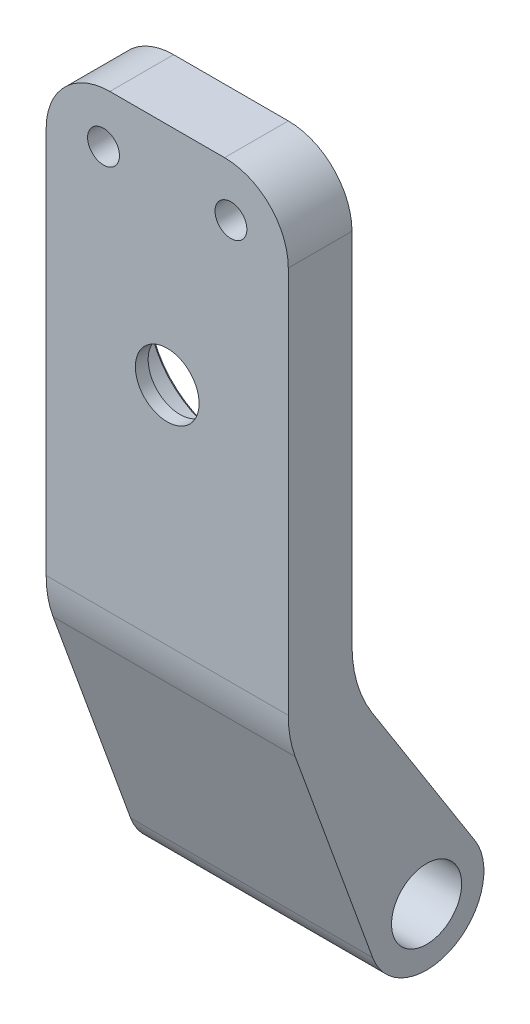
ISO-10303-21;
HEADER;
FILE_DESCRIPTION(('STEP AP214'),'2;1');
FILE_NAME('part.step','',(''),(''),'','','');
FILE_SCHEMA(('AUTOMOTIVE_DESIGN { 1 0 10303 214 1 1 1 1 }'));
ENDSEC;
DATA;
#1=APPLICATION_CONTEXT('core data for automotive mechanical design processes');
#2=APPLICATION_PROTOCOL_DEFINITION('international standard','automotive_design',2000,#1);
#3=PRODUCT_CONTEXT('',#1,'mechanical');
#4=PRODUCT('Part','Part','',(#3));
#5=PRODUCT_RELATED_PRODUCT_CATEGORY('part','',(#4));
#6=PRODUCT_DEFINITION_FORMATION('','',#4);
#7=PRODUCT_DEFINITION_CONTEXT('part definition',#1,'design');
#8=PRODUCT_DEFINITION('design','',#6,#7);
#9=PRODUCT_DEFINITION_SHAPE('','',#8);
#10=(LENGTH_UNIT() NAMED_UNIT(*) SI_UNIT(.MILLI.,.METRE.));
#11=(NAMED_UNIT(*) PLANE_ANGLE_UNIT() SI_UNIT($,.RADIAN.));
#12=(NAMED_UNIT(*) SI_UNIT($,.STERADIAN.) SOLID_ANGLE_UNIT());
#13=UNCERTAINTY_MEASURE_WITH_UNIT(LENGTH_MEASURE(1.E-05),#10,'distance_accuracy_value','');
#14=(GEOMETRIC_REPRESENTATION_CONTEXT(3) GLOBAL_UNCERTAINTY_ASSIGNED_CONTEXT((#13)) GLOBAL_UNIT_ASSIGNED_CONTEXT((#10,
#11,#12)) REPRESENTATION_CONTEXT('',''));
#15=CARTESIAN_POINT('',(0.,0.,0.));
#16=DIRECTION('',(0.,0.,1.));
#17=DIRECTION('',(1.,0.,0.));
#18=AXIS2_PLACEMENT_3D('',#15,#16,#17);
#19=CARTESIAN_POINT('',(0.,13.1015537091819,20.7143094769658));
#20=DIRECTION('',(0.,0.,-1.));
#21=DIRECTION('',(-1.,0.,0.));
#22=AXIS2_PLACEMENT_3D('',#19,#20,#21);
#23=CONICAL_SURFACE('',#22,6.,0.785398163397448);
#24=CARTESIAN_POINT('',(0.,13.1015537091819,20.2143094769658));
#25=DIRECTION('',(0.,0.,1.));
#26=DIRECTION('',(-1.,0.,0.));
#27=AXIS2_PLACEMENT_3D('',#24,#25,#26);
#28=CIRCLE('',#27,6.5);
#29=CARTESIAN_POINT('',(-6.5,13.1015537091819,20.2143094769658));
#30=VERTEX_POINT('',#29);
#31=EDGE_CURVE('E197',#30,#30,#28,.T.);
#32=ORIENTED_EDGE('',*,*,#31,.F.);
#33=EDGE_LOOP('',(#32));
#34=FACE_BOUND('',#33,.T.);
#35=CARTESIAN_POINT('',(0.,13.1015537091819,20.4643094769658));
#36=DIRECTION('',(0.,0.,-1.));
#37=DIRECTION('',(-1.,0.,0.));
#38=AXIS2_PLACEMENT_3D('',#35,#36,#37);
#39=CIRCLE('',#38,6.25);
#40=CARTESIAN_POINT('',(-6.25,13.1015537091819,20.4643094769658));
#41=VERTEX_POINT('',#40);
#42=EDGE_CURVE('E52',#41,#41,#39,.T.);
#43=ORIENTED_EDGE('',*,*,#42,.F.);
#44=EDGE_LOOP('',(#43));
#45=FACE_BOUND('',#44,.T.);
#46=ADVANCED_FACE('F48',(#34,#45),#23,.F.);
#47=CARTESIAN_POINT('',(9.5,7.60659887027264,25.2143094769657));
#48=DIRECTION('',(0.,0.,-1.));
#49=DIRECTION('',(-1.,0.,0.));
#50=AXIS2_PLACEMENT_3D('',#47,#48,#49);
#51=PLANE('',#50);
#52=CARTESIAN_POINT('',(0.,13.1015537091819,25.2143094769657));
#53=DIRECTION('',(0.,0.,-1.));
#54=DIRECTION('',(0.,1.,0.));
#55=AXIS2_PLACEMENT_3D('',#52,#53,#54);
#56=CIRCLE('',#55,2.5);
#57=CARTESIAN_POINT('',(0.,15.6015537091819,25.2143094769657));
#58=VERTEX_POINT('',#57);
#59=EDGE_CURVE('E13',#58,#58,#56,.T.);
#60=ORIENTED_EDGE('',*,*,#59,.T.);
#61=EDGE_LOOP('',(#60));
#62=FACE_BOUND('',#61,.T.);
#63=CARTESIAN_POINT('',(-5.,26.8080822959938,25.2143094769657));
#64=DIRECTION('',(0.,0.,1.));
#65=DIRECTION('',(0.,-1.,0.));
#66=AXIS2_PLACEMENT_3D('',#63,#64,#65);
#67=CIRCLE('',#66,1.25);
#68=CARTESIAN_POINT('',(-5.,25.5580822959938,25.2143094769657));
#69=VERTEX_POINT('',#68);
#70=EDGE_CURVE('E235',#69,#69,#67,.T.);
#71=ORIENTED_EDGE('',*,*,#70,.F.);
#72=EDGE_LOOP('',(#71));
#73=FACE_BOUND('',#72,.T.);
#74=CARTESIAN_POINT('',(5.,26.8080822959938,25.2143094769657));
#75=DIRECTION('',(0.,0.,1.));
#76=DIRECTION('',(0.,-1.,0.));
#77=AXIS2_PLACEMENT_3D('',#74,#75,#76);
#78=CIRCLE('',#77,1.25);
#79=CARTESIAN_POINT('',(5.,25.5580822959938,25.2143094769657));
#80=VERTEX_POINT('',#79);
#81=EDGE_CURVE('E229',#80,#80,#78,.T.);
#82=ORIENTED_EDGE('',*,*,#81,.F.);
#83=EDGE_LOOP('',(#82));
#84=FACE_BOUND('',#83,.T.);
#85=DIRECTION('',(-1.,0.,0.));
#86=VECTOR('',#85,1.);
#87=CARTESIAN_POINT('',(9.5,30.8080822959938,25.2143094769657));
#88=LINE('',#87,#86);
#89=CARTESIAN_POINT('',(4.5,30.8080822959938,25.2143094769657));
#90=VERTEX_POINT('',#89);
#91=CARTESIAN_POINT('',(-4.5,30.8080822959938,25.2143094769657));
#92=VERTEX_POINT('',#91);
#93=EDGE_CURVE('E58',#90,#92,#88,.T.);
#94=ORIENTED_EDGE('',*,*,#93,.T.);
#95=CARTESIAN_POINT('',(-4.5,25.8080822959938,25.2143094769657));
#96=DIRECTION('',(0.,0.,1.));
#97=DIRECTION('',(0.,1.,0.));
#98=AXIS2_PLACEMENT_3D('',#95,#96,#97);
#99=CIRCLE('',#98,5.);
#100=CARTESIAN_POINT('',(-9.5,25.8080822959938,25.2143094769657));
#101=VERTEX_POINT('',#100);
#102=EDGE_CURVE('E194',#92,#101,#99,.T.);
#103=ORIENTED_EDGE('',*,*,#102,.T.);
#104=DIRECTION('',(0.,-1.,0.));
#105=VECTOR('',#104,1.);
#106=CARTESIAN_POINT('',(-9.5,7.60659887027264,25.2143094769657));
#107=LINE('',#106,#105);
#108=CARTESIAN_POINT('',(-9.5,-4.59488455544854,25.2143094769657));
#109=VERTEX_POINT('',#108);
#110=EDGE_CURVE('E112',#101,#109,#107,.T.);
#111=ORIENTED_EDGE('',*,*,#110,.T.);
#112=DIRECTION('',(-1.,0.,0.));
#113=VECTOR('',#112,1.);
#114=CARTESIAN_POINT('',(9.5,-4.59488455544854,25.2143094769657));
#115=LINE('',#114,#113);
#116=CARTESIAN_POINT('',(9.5,-4.59488455544854,25.2143094769657));
#117=VERTEX_POINT('',#116);
#118=EDGE_CURVE('E122',#117,#109,#115,.T.);
#119=ORIENTED_EDGE('',*,*,#118,.F.);
#120=DIRECTION('',(0.,-1.,0.));
#121=VECTOR('',#120,1.);
#122=CARTESIAN_POINT('',(9.5,7.60659887027264,25.2143094769657));
#123=LINE('',#122,#121);
#124=CARTESIAN_POINT('',(9.5,25.8080822959938,25.2143094769657));
#125=VERTEX_POINT('',#124);
#126=EDGE_CURVE('E221',#125,#117,#123,.T.);
#127=ORIENTED_EDGE('',*,*,#126,.F.);
#128=CARTESIAN_POINT('',(4.5,25.8080822959938,25.2143094769657));
#129=DIRECTION('',(0.,0.,1.));
#130=DIRECTION('',(0.,1.,0.));
#131=AXIS2_PLACEMENT_3D('',#128,#129,#130);
#132=CIRCLE('',#131,5.);
#133=EDGE_CURVE('E195',#125,#90,#132,.T.);
#134=ORIENTED_EDGE('',*,*,#133,.T.);
#135=EDGE_LOOP('',(#94,#103,#111,#119,#127,#134));
#136=FACE_BOUND('',#135,.T.);
#137=ADVANCED_FACE('F50',(#62,#73,#84,#136),#51,.F.);
#138=CARTESIAN_POINT('',(9.5,-4.59488455544854,16.2143094769658));
#139=DIRECTION('',(-1.,0.,0.));
#140=DIRECTION('',(0.,0.,1.));
#141=AXIS2_PLACEMENT_3D('',#138,#139,#140);
#142=CYLINDRICAL_SURFACE('',#141,9.);
#143=CARTESIAN_POINT('',(-9.5,-4.59488455544854,16.2143094769658));
#144=DIRECTION('',(1.,0.,0.));
#145=DIRECTION('',(0.,0.,-1.));
#146=AXIS2_PLACEMENT_3D('',#143,#144,#145);
#147=CIRCLE('',#146,9.);
#148=CARTESIAN_POINT('',(-9.5,-7.67306584537955,24.671543064039));
#149=VERTEX_POINT('',#148);
#150=EDGE_CURVE('E225',#109,#149,#147,.T.);
#151=ORIENTED_EDGE('',*,*,#150,.T.);
#152=DIRECTION('',(-1.,0.,0.));
#153=VECTOR('',#152,1.);
#154=CARTESIAN_POINT('',(9.5,-7.67306584537955,24.671543064039));
#155=LINE('',#154,#153);
#156=CARTESIAN_POINT('',(9.5,-7.67306584537955,24.671543064039));
#157=VERTEX_POINT('',#156);
#158=EDGE_CURVE('E200',#157,#149,#155,.T.);
#159=ORIENTED_EDGE('',*,*,#158,.F.);
#160=CARTESIAN_POINT('',(9.5,-4.59488455544854,16.2143094769658));
#161=DIRECTION('',(1.,0.,0.));
#162=DIRECTION('',(0.,0.,-1.));
#163=AXIS2_PLACEMENT_3D('',#160,#161,#162);
#164=CIRCLE('',#163,9.);
#165=EDGE_CURVE('E210',#117,#157,#164,.T.);
#166=ORIENTED_EDGE('',*,*,#165,.F.);
#167=ORIENTED_EDGE('',*,*,#118,.T.);
#168=EDGE_LOOP('',(#151,#159,#166,#167));
#169=FACE_BOUND('',#168,.T.);
#170=ADVANCED_FACE('F285',(#169),#142,.T.);
#171=CARTESIAN_POINT('',(9.5,-16.0287039880252,21.6303394918166));
#172=DIRECTION('',(0.,-0.342020143325669,0.939692620785908));
#173=DIRECTION('',(-1.,0.,0.));
#174=AXIS2_PLACEMENT_3D('',#171,#172,#173);
#175=PLANE('',#174);
#176=DIRECTION('',(0.,0.939692620785908,0.342020143325669));
#177=VECTOR('',#176,1.);
#178=CARTESIAN_POINT('',(-9.5,-16.0287039880252,21.6303394918166));
#179=LINE('',#178,#177);
#180=CARTESIAN_POINT('',(-9.5,-24.3843421306709,18.5891359195942));
#181=VERTEX_POINT('',#180);
#182=EDGE_CURVE('E226',#181,#149,#179,.T.);
#183=ORIENTED_EDGE('',*,*,#182,.F.);
#184=DIRECTION('',(-1.,0.,0.));
#185=VECTOR('',#184,1.);
#186=CARTESIAN_POINT('',(9.5,-24.3843421306709,18.5891359195942));
#187=LINE('',#186,#185);
#188=CARTESIAN_POINT('',(9.5,-24.3843421306709,18.5891359195942));
#189=VERTEX_POINT('',#188);
#190=EDGE_CURVE('E218',#189,#181,#187,.T.);
#191=ORIENTED_EDGE('',*,*,#190,.F.);
#192=DIRECTION('',(0.,0.939692620785908,0.342020143325669));
#193=VECTOR('',#192,1.);
#194=CARTESIAN_POINT('',(9.5,-16.0287039880252,21.6303394918166));
#195=LINE('',#194,#193);
#196=EDGE_CURVE('E202',#189,#157,#195,.T.);
#197=ORIENTED_EDGE('',*,*,#196,.T.);
#198=ORIENTED_EDGE('',*,*,#158,.T.);
#199=EDGE_LOOP('',(#183,#191,#197,#198));
#200=FACE_BOUND('',#199,.T.);
#201=ADVANCED_FACE('F262',(#200),#175,.T.);
#202=CARTESIAN_POINT('',(9.5,-22.8452514857054,14.3605191260576));
#203=DIRECTION('',(-1.,0.,0.));
#204=DIRECTION('',(0.,0.,1.));
#205=AXIS2_PLACEMENT_3D('',#202,#203,#204);
#206=CYLINDRICAL_SURFACE('',#205,4.5);
#207=CARTESIAN_POINT('',(-9.5,-22.8452514857054,14.3605191260576));
#208=DIRECTION('',(1.,0.,0.));
#209=DIRECTION('',(0.,0.,-1.));
#210=AXIS2_PLACEMENT_3D('',#207,#208,#209);
#211=CIRCLE('',#210,4.5);
#212=CARTESIAN_POINT('',(-9.5,-20.4343265102656,10.5608558827161));
#213=VERTEX_POINT('',#212);
#214=EDGE_CURVE('E203',#181,#213,#211,.T.);
#215=ORIENTED_EDGE('',*,*,#214,.T.);
#216=DIRECTION('',(-1.,0.,0.));
#217=VECTOR('',#216,1.);
#218=CARTESIAN_POINT('',(9.5,-20.4343265102656,10.5608558827161));
#219=LINE('',#218,#217);
#220=CARTESIAN_POINT('',(9.5,-20.4343265102656,10.5608558827161));
#221=VERTEX_POINT('',#220);
#222=EDGE_CURVE('E204',#221,#213,#219,.T.);
#223=ORIENTED_EDGE('',*,*,#222,.F.);
#224=CARTESIAN_POINT('',(9.5,-22.8452514857054,14.3605191260576));
#225=DIRECTION('',(1.,0.,0.));
#226=DIRECTION('',(0.,0.,-1.));
#227=AXIS2_PLACEMENT_3D('',#224,#225,#226);
#228=CIRCLE('',#227,4.5);
#229=EDGE_CURVE('E150',#189,#221,#228,.T.);
#230=ORIENTED_EDGE('',*,*,#229,.F.);
#231=ORIENTED_EDGE('',*,*,#190,.T.);
#232=EDGE_LOOP('',(#215,#223,#230,#231));
#233=FACE_BOUND('',#232,.T.);
#234=ADVANCED_FACE('F259',(#233),#206,.T.);
#235=CARTESIAN_POINT('',(9.5,-14.0536961778226,14.6094307279982));
#236=DIRECTION('',(0.,0.535761105653282,-0.844369609631453));
#237=DIRECTION('',(-1.,0.,0.));
#238=AXIS2_PLACEMENT_3D('',#235,#236,#237);
#239=PLANE('',#238);
#240=DIRECTION('',(0.,-0.844369609631453,-0.535761105653282));
#241=VECTOR('',#240,1.);
#242=CARTESIAN_POINT('',(-9.5,-14.0536961778226,14.6094307279982));
#243=LINE('',#242,#241);
#244=CARTESIAN_POINT('',(-9.5,-7.67306584537955,18.6580055732803));
#245=VERTEX_POINT('',#244);
#246=EDGE_CURVE('E144',#245,#213,#243,.T.);
#247=ORIENTED_EDGE('',*,*,#246,.F.);
#248=DIRECTION('',(-1.,0.,0.));
#249=VECTOR('',#248,1.);
#250=CARTESIAN_POINT('',(9.5,-7.67306584537955,18.6580055732803));
#251=LINE('',#250,#249);
#252=CARTESIAN_POINT('',(9.5,-7.67306584537955,18.6580055732803));
#253=VERTEX_POINT('',#252);
#254=EDGE_CURVE('E141',#253,#245,#251,.T.);
#255=ORIENTED_EDGE('',*,*,#254,.F.);
#256=DIRECTION('',(0.,-0.844369609631453,-0.535761105653282));
#257=VECTOR('',#256,1.);
#258=CARTESIAN_POINT('',(9.5,-14.0536961778226,14.6094307279982));
#259=LINE('',#258,#257);
#260=EDGE_CURVE('E206',#253,#221,#259,.T.);
#261=ORIENTED_EDGE('',*,*,#260,.T.);
#262=ORIENTED_EDGE('',*,*,#222,.T.);
#263=EDGE_LOOP('',(#247,#255,#261,#262));
#264=FACE_BOUND('',#263,.T.);
#265=ADVANCED_FACE('F252',(#264),#239,.T.);
#266=CARTESIAN_POINT('',(9.5,-2.31545478884673,10.2143094769657));
#267=DIRECTION('',(-1.,0.,0.));
#268=DIRECTION('',(0.,0.,1.));
#269=AXIS2_PLACEMENT_3D('',#266,#267,#268);
#270=CYLINDRICAL_SURFACE('',#269,10.);
#271=CARTESIAN_POINT('',(-9.5,-2.31545478884673,10.2143094769657));
#272=DIRECTION('',(1.,0.,0.));
#273=DIRECTION('',(0.,0.,-1.));
#274=AXIS2_PLACEMENT_3D('',#271,#272,#273);
#275=CIRCLE('',#274,10.);
#276=CARTESIAN_POINT('',(-9.5,-2.31545478884673,20.2143094769658));
#277=VERTEX_POINT('',#276);
#278=EDGE_CURVE('E175',#277,#245,#275,.T.);
#279=ORIENTED_EDGE('',*,*,#278,.F.);
#280=DIRECTION('',(-1.,0.,0.));
#281=VECTOR('',#280,1.);
#282=CARTESIAN_POINT('',(9.5,-2.31545478884673,20.2143094769658));
#283=LINE('',#282,#281);
#284=CARTESIAN_POINT('',(9.5,-2.31545478884673,20.2143094769658));
#285=VERTEX_POINT('',#284);
#286=EDGE_CURVE('E172',#285,#277,#283,.T.);
#287=ORIENTED_EDGE('',*,*,#286,.F.);
#288=CARTESIAN_POINT('',(9.5,-2.31545478884673,10.2143094769657));
#289=DIRECTION('',(1.,0.,0.));
#290=DIRECTION('',(0.,0.,-1.));
#291=AXIS2_PLACEMENT_3D('',#288,#289,#290);
#292=CIRCLE('',#291,10.);
#293=EDGE_CURVE('E196',#285,#253,#292,.T.);
#294=ORIENTED_EDGE('',*,*,#293,.T.);
#295=ORIENTED_EDGE('',*,*,#254,.T.);
#296=EDGE_LOOP('',(#279,#287,#294,#295));
#297=FACE_BOUND('',#296,.T.);
#298=ADVANCED_FACE('F256',(#297),#270,.F.);
#299=CARTESIAN_POINT('',(9.5,7.91732382523638,20.2143094769658));
#300=DIRECTION('',(0.,0.,-1.));
#301=DIRECTION('',(0.,-1.,0.));
#302=AXIS2_PLACEMENT_3D('',#299,#300,#301);
#303=PLANE('',#302);
#304=ORIENTED_EDGE('',*,*,#31,.T.);
#305=EDGE_LOOP('',(#304));
#306=FACE_BOUND('',#305,.T.);
#307=CARTESIAN_POINT('',(-5.,26.8080822959938,20.2143094769658));
#308=DIRECTION('',(0.,0.,1.));
#309=DIRECTION('',(-1.,0.,0.));
#310=AXIS2_PLACEMENT_3D('',#307,#308,#309);
#311=CIRCLE('',#310,1.25);
#312=CARTESIAN_POINT('',(-6.25,26.8080822959938,20.2143094769658));
#313=VERTEX_POINT('',#312);
#314=EDGE_CURVE('E209',#313,#313,#311,.T.);
#315=ORIENTED_EDGE('',*,*,#314,.T.);
#316=EDGE_LOOP('',(#315));
#317=FACE_BOUND('',#316,.T.);
#318=CARTESIAN_POINT('',(5.,26.8080822959938,20.2143094769658));
#319=DIRECTION('',(0.,0.,1.));
#320=DIRECTION('',(-1.,0.,0.));
#321=AXIS2_PLACEMENT_3D('',#318,#319,#320);
#322=CIRCLE('',#321,1.25);
#323=CARTESIAN_POINT('',(3.75,26.8080822959938,20.2143094769658));
#324=VERTEX_POINT('',#323);
#325=EDGE_CURVE('E182',#324,#324,#322,.T.);
#326=ORIENTED_EDGE('',*,*,#325,.T.);
#327=EDGE_LOOP('',(#326));
#328=FACE_BOUND('',#327,.T.);
#329=DIRECTION('',(0.,-1.,0.));
#330=VECTOR('',#329,1.);
#331=CARTESIAN_POINT('',(-9.5,7.91732382523638,20.2143094769658));
#332=LINE('',#331,#330);
#333=CARTESIAN_POINT('',(-9.5,25.8080822959938,20.2143094769658));
#334=VERTEX_POINT('',#333);
#335=EDGE_CURVE('E166',#334,#277,#332,.T.);
#336=ORIENTED_EDGE('',*,*,#335,.F.);
#337=CARTESIAN_POINT('',(-4.5,25.8080822959938,20.2143094769658));
#338=DIRECTION('',(0.,0.,-1.));
#339=DIRECTION('',(-1.,0.,0.));
#340=AXIS2_PLACEMENT_3D('',#337,#338,#339);
#341=CIRCLE('',#340,5.);
#342=CARTESIAN_POINT('',(-4.5,30.8080822959938,20.2143094769658));
#343=VERTEX_POINT('',#342);
#344=EDGE_CURVE('E169',#334,#343,#341,.T.);
#345=ORIENTED_EDGE('',*,*,#344,.T.);
#346=DIRECTION('',(-1.,0.,0.));
#347=VECTOR('',#346,1.);
#348=CARTESIAN_POINT('',(9.5,30.8080822959938,20.2143094769658));
#349=LINE('',#348,#347);
#350=CARTESIAN_POINT('',(4.5,30.8080822959938,20.2143094769658));
#351=VERTEX_POINT('',#350);
#352=EDGE_CURVE('E215',#351,#343,#349,.T.);
#353=ORIENTED_EDGE('',*,*,#352,.F.);
#354=CARTESIAN_POINT('',(4.5,25.8080822959938,20.2143094769658));
#355=DIRECTION('',(0.,0.,-1.));
#356=DIRECTION('',(-1.,0.,0.));
#357=AXIS2_PLACEMENT_3D('',#354,#355,#356);
#358=CIRCLE('',#357,5.);
#359=CARTESIAN_POINT('',(9.5,25.8080822959938,20.2143094769658));
#360=VERTEX_POINT('',#359);
#361=EDGE_CURVE('E183',#351,#360,#358,.T.);
#362=ORIENTED_EDGE('',*,*,#361,.T.);
#363=DIRECTION('',(0.,-1.,0.));
#364=VECTOR('',#363,1.);
#365=CARTESIAN_POINT('',(9.5,7.91732382523638,20.2143094769658));
#366=LINE('',#365,#364);
#367=EDGE_CURVE('E231',#360,#285,#366,.T.);
#368=ORIENTED_EDGE('',*,*,#367,.T.);
#369=ORIENTED_EDGE('',*,*,#286,.T.);
#370=EDGE_LOOP('',(#336,#345,#353,#362,#368,#369));
#371=FACE_BOUND('',#370,.T.);
#372=ADVANCED_FACE('F168',(#306,#317,#328,#371),#303,.T.);
#373=CARTESIAN_POINT('',(9.5,-22.8452514857054,14.3605191260576));
#374=DIRECTION('',(-1.,0.,0.));
#375=DIRECTION('',(0.,0.,1.));
#376=AXIS2_PLACEMENT_3D('',#373,#374,#375);
#377=CYLINDRICAL_SURFACE('',#376,2.75);
#378=CARTESIAN_POINT('',(9.5,-22.8452514857054,14.3605191260576));
#379=DIRECTION('',(1.,0.,0.));
#380=DIRECTION('',(0.,0.,-1.));
#381=AXIS2_PLACEMENT_3D('',#378,#379,#380);
#382=CIRCLE('',#381,2.75);
#383=CARTESIAN_POINT('',(9.5,-22.8452514857054,11.6105191260576));
#384=VERTEX_POINT('',#383);
#385=EDGE_CURVE('E212',#384,#384,#382,.T.);
#386=ORIENTED_EDGE('',*,*,#385,.T.);
#387=EDGE_LOOP('',(#386));
#388=FACE_BOUND('',#387,.T.);
#389=CARTESIAN_POINT('',(-9.5,-22.8452514857054,14.3605191260576));
#390=DIRECTION('',(1.,0.,0.));
#391=DIRECTION('',(0.,0.,-1.));
#392=AXIS2_PLACEMENT_3D('',#389,#390,#391);
#393=CIRCLE('',#392,2.75);
#394=CARTESIAN_POINT('',(-9.5,-22.8452514857054,11.6105191260576));
#395=VERTEX_POINT('',#394);
#396=EDGE_CURVE('E186',#395,#395,#393,.T.);
#397=ORIENTED_EDGE('',*,*,#396,.F.);
#398=EDGE_LOOP('',(#397));
#399=FACE_BOUND('',#398,.T.);
#400=ADVANCED_FACE('F329',(#388,#399),#377,.F.);
#401=CARTESIAN_POINT('',(9.5,30.8080822959938,22.7143094769658));
#402=DIRECTION('',(0.,1.,0.));
#403=DIRECTION('',(1.,0.,0.));
#404=AXIS2_PLACEMENT_3D('',#401,#402,#403);
#405=PLANE('',#404);
#406=ORIENTED_EDGE('',*,*,#352,.T.);
#407=DIRECTION('',(0.,0.,1.));
#408=VECTOR('',#407,1.);
#409=CARTESIAN_POINT('',(-4.5,30.8080822959938,25.2143094769657));
#410=LINE('',#409,#408);
#411=EDGE_CURVE('E181',#343,#92,#410,.T.);
#412=ORIENTED_EDGE('',*,*,#411,.T.);
#413=ORIENTED_EDGE('',*,*,#93,.F.);
#414=DIRECTION('',(0.,0.,-1.));
#415=VECTOR('',#414,1.);
#416=CARTESIAN_POINT('',(4.5,30.8080822959938,22.7143094769658));
#417=LINE('',#416,#415);
#418=EDGE_CURVE('E240',#90,#351,#417,.T.);
#419=ORIENTED_EDGE('',*,*,#418,.T.);
#420=EDGE_LOOP('',(#406,#412,#413,#419));
#421=FACE_BOUND('',#420,.T.);
#422=ADVANCED_FACE('F292',(#421),#405,.T.);
#423=CARTESIAN_POINT('',(9.5,1.73141540514422,17.5374143015117));
#424=DIRECTION('',(1.,0.,0.));
#425=DIRECTION('',(0.,1.,0.));
#426=AXIS2_PLACEMENT_3D('',#423,#424,#425);
#427=PLANE('',#426);
#428=ORIENTED_EDGE('',*,*,#385,.F.);
#429=EDGE_LOOP('',(#428));
#430=FACE_BOUND('',#429,.T.);
#431=ORIENTED_EDGE('',*,*,#367,.F.);
#432=DIRECTION('',(0.,0.,1.));
#433=VECTOR('',#432,1.);
#434=CARTESIAN_POINT('',(9.5,25.8080822959938,17.5374143015117));
#435=LINE('',#434,#433);
#436=EDGE_CURVE('E192',#360,#125,#435,.T.);
#437=ORIENTED_EDGE('',*,*,#436,.T.);
#438=ORIENTED_EDGE('',*,*,#126,.T.);
#439=ORIENTED_EDGE('',*,*,#165,.T.);
#440=ORIENTED_EDGE('',*,*,#196,.F.);
#441=ORIENTED_EDGE('',*,*,#229,.T.);
#442=ORIENTED_EDGE('',*,*,#260,.F.);
#443=ORIENTED_EDGE('',*,*,#293,.F.);
#444=EDGE_LOOP('',(#431,#437,#438,#439,#440,#441,#442,#443));
#445=FACE_BOUND('',#444,.T.);
#446=ADVANCED_FACE('F254',(#430,#445),#427,.T.);
#447=CARTESIAN_POINT('',(-9.5,1.73141540514422,17.5374143015117));
#448=DIRECTION('',(1.,0.,0.));
#449=DIRECTION('',(0.,1.,0.));
#450=AXIS2_PLACEMENT_3D('',#447,#448,#449);
#451=PLANE('',#450);
#452=ORIENTED_EDGE('',*,*,#396,.T.);
#453=EDGE_LOOP('',(#452));
#454=FACE_BOUND('',#453,.T.);
#455=ORIENTED_EDGE('',*,*,#110,.F.);
#456=DIRECTION('',(0.,0.,-1.));
#457=VECTOR('',#456,1.);
#458=CARTESIAN_POINT('',(-9.5,25.8080822959938,20.2143094769658));
#459=LINE('',#458,#457);
#460=EDGE_CURVE('E174',#101,#334,#459,.T.);
#461=ORIENTED_EDGE('',*,*,#460,.T.);
#462=ORIENTED_EDGE('',*,*,#335,.T.);
#463=ORIENTED_EDGE('',*,*,#278,.T.);
#464=ORIENTED_EDGE('',*,*,#246,.T.);
#465=ORIENTED_EDGE('',*,*,#214,.F.);
#466=ORIENTED_EDGE('',*,*,#182,.T.);
#467=ORIENTED_EDGE('',*,*,#150,.F.);
#468=EDGE_LOOP('',(#455,#461,#462,#463,#464,#465,#466,#467));
#469=FACE_BOUND('',#468,.T.);
#470=ADVANCED_FACE('F185',(#454,#469),#451,.F.);
#471=CARTESIAN_POINT('',(-4.5,25.8080822959938,17.5374143015117));
#472=DIRECTION('',(0.,0.,1.));
#473=DIRECTION('',(1.,0.,0.));
#474=AXIS2_PLACEMENT_3D('',#471,#472,#473);
#475=CYLINDRICAL_SURFACE('',#474,5.);
#476=ORIENTED_EDGE('',*,*,#102,.F.);
#477=ORIENTED_EDGE('',*,*,#411,.F.);
#478=ORIENTED_EDGE('',*,*,#344,.F.);
#479=ORIENTED_EDGE('',*,*,#460,.F.);
#480=EDGE_LOOP('',(#476,#477,#478,#479));
#481=FACE_BOUND('',#480,.T.);
#482=ADVANCED_FACE('F179',(#481),#475,.T.);
#483=CARTESIAN_POINT('',(4.5,25.8080822959938,22.7143094769658));
#484=DIRECTION('',(0.,0.,-1.));
#485=DIRECTION('',(-1.,0.,0.));
#486=AXIS2_PLACEMENT_3D('',#483,#484,#485);
#487=CYLINDRICAL_SURFACE('',#486,5.);
#488=ORIENTED_EDGE('',*,*,#133,.F.);
#489=ORIENTED_EDGE('',*,*,#436,.F.);
#490=ORIENTED_EDGE('',*,*,#361,.F.);
#491=ORIENTED_EDGE('',*,*,#418,.F.);
#492=EDGE_LOOP('',(#488,#489,#490,#491));
#493=FACE_BOUND('',#492,.T.);
#494=ADVANCED_FACE('F296',(#493),#487,.T.);
#495=CARTESIAN_POINT('',(5.,26.8080822959938,17.5887715900735));
#496=DIRECTION('',(0.,0.,1.));
#497=DIRECTION('',(0.,-1.,0.));
#498=AXIS2_PLACEMENT_3D('',#495,#496,#497);
#499=CYLINDRICAL_SURFACE('',#498,1.25);
#500=ORIENTED_EDGE('',*,*,#325,.F.);
#501=EDGE_LOOP('',(#500));
#502=FACE_BOUND('',#501,.T.);
#503=ORIENTED_EDGE('',*,*,#81,.T.);
#504=EDGE_LOOP('',(#503));
#505=FACE_BOUND('',#504,.T.);
#506=ADVANCED_FACE('F280',(#502,#505),#499,.F.);
#507=CARTESIAN_POINT('',(-5.,26.8080822959938,17.5887715900735));
#508=DIRECTION('',(0.,0.,1.));
#509=DIRECTION('',(0.,-1.,0.));
#510=AXIS2_PLACEMENT_3D('',#507,#508,#509);
#511=CYLINDRICAL_SURFACE('',#510,1.25);
#512=ORIENTED_EDGE('',*,*,#314,.F.);
#513=EDGE_LOOP('',(#512));
#514=FACE_BOUND('',#513,.T.);
#515=ORIENTED_EDGE('',*,*,#70,.T.);
#516=EDGE_LOOP('',(#515));
#517=FACE_BOUND('',#516,.T.);
#518=ADVANCED_FACE('F276',(#514,#517),#511,.F.);
#519=CARTESIAN_POINT('',(0.,13.1015537091819,16.5143094769657));
#520=DIRECTION('',(0.,0.,1.));
#521=DIRECTION('',(1.,0.,0.));
#522=AXIS2_PLACEMENT_3D('',#519,#520,#521);
#523=CYLINDRICAL_SURFACE('',#522,2.5);
#524=ORIENTED_EDGE('',*,*,#59,.F.);
#525=EDGE_LOOP('',(#524));
#526=FACE_BOUND('',#525,.T.);
#527=CARTESIAN_POINT('',(0.,13.1015537091819,24.2143094769658));
#528=DIRECTION('',(0.,0.,-1.));
#529=DIRECTION('',(-1.,0.,0.));
#530=AXIS2_PLACEMENT_3D('',#527,#528,#529);
#531=CIRCLE('',#530,2.5);
#532=CARTESIAN_POINT('',(-2.5,13.1015537091819,24.2143094769658));
#533=VERTEX_POINT('',#532);
#534=EDGE_CURVE('E250',#533,#533,#531,.T.);
#535=ORIENTED_EDGE('',*,*,#534,.T.);
#536=EDGE_LOOP('',(#535));
#537=FACE_BOUND('',#536,.T.);
#538=ADVANCED_FACE('F279',(#526,#537),#523,.F.);
#539=CARTESIAN_POINT('',(0.,13.1015537091819,24.2143094769658));
#540=DIRECTION('',(0.,0.,-1.));
#541=DIRECTION('',(-1.,0.,0.));
#542=AXIS2_PLACEMENT_3D('',#539,#540,#541);
#543=PLANE('',#542);
#544=ORIENTED_EDGE('',*,*,#534,.F.);
#545=EDGE_LOOP('',(#544));
#546=FACE_BOUND('',#545,.T.);
#547=CARTESIAN_POINT('',(0.,13.1015537091819,24.2143094769658));
#548=DIRECTION('',(0.,0.,-1.));
#549=DIRECTION('',(-1.,0.,0.));
#550=AXIS2_PLACEMENT_3D('',#547,#548,#549);
#551=CIRCLE('',#550,6.25);
#552=CARTESIAN_POINT('',(-6.25,13.1015537091819,24.2143094769658));
#553=VERTEX_POINT('',#552);
#554=EDGE_CURVE('E448',#553,#553,#551,.T.);
#555=ORIENTED_EDGE('',*,*,#554,.T.);
#556=EDGE_LOOP('',(#555));
#557=FACE_BOUND('',#556,.T.);
#558=ADVANCED_FACE('F336',(#546,#557),#543,.T.);
#559=CARTESIAN_POINT('',(0.,13.1015537091819,9.8605191260576));
#560=DIRECTION('',(0.,0.,1.));
#561=DIRECTION('',(1.,0.,0.));
#562=AXIS2_PLACEMENT_3D('',#559,#560,#561);
#563=CYLINDRICAL_SURFACE('',#562,6.25);
#564=ORIENTED_EDGE('',*,*,#554,.F.);
#565=EDGE_LOOP('',(#564));
#566=FACE_BOUND('',#565,.T.);
#567=ORIENTED_EDGE('',*,*,#42,.T.);
#568=EDGE_LOOP('',(#567));
#569=FACE_BOUND('',#568,.T.);
#570=ADVANCED_FACE('F432',(#566,#569),#563,.F.);
#571=CLOSED_SHELL('',(#46,#137,#170,#201,#234,#265,#298,#372,#400,#422,#446,#470,#482,#494,#506,
#518,#538,#558,#570));
#572=MANIFOLD_SOLID_BREP('B2',#571);
#573=ADVANCED_BREP_SHAPE_REPRESENTATION('',(#18,#572),#14);
#574=SHAPE_DEFINITION_REPRESENTATION(#9,#573);
ENDSEC;
END-ISO-10303-21;
